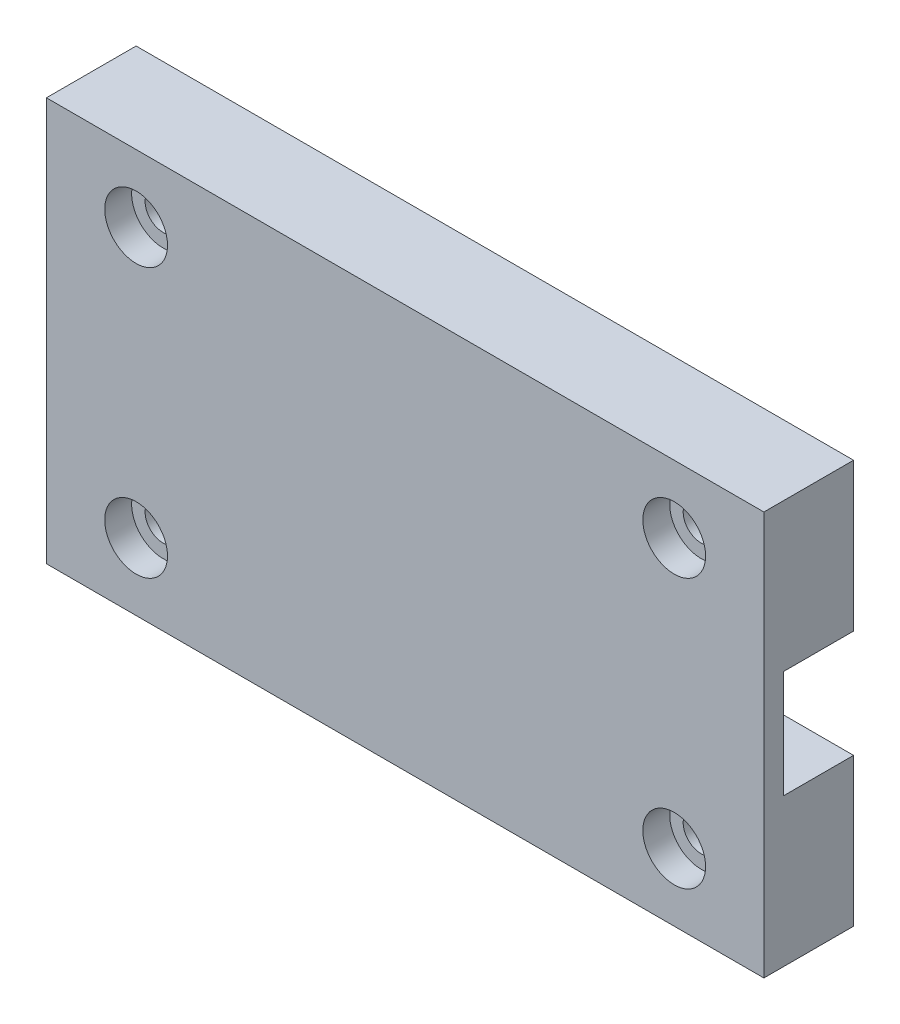
ISO-10303-21;
HEADER;
FILE_DESCRIPTION(('STEP AP214'),'2;1');
FILE_NAME('part.step','',(''),(''),'','','');
FILE_SCHEMA(('AUTOMOTIVE_DESIGN { 1 0 10303 214 1 1 1 1 }'));
ENDSEC;
DATA;
#1=APPLICATION_CONTEXT('core data for automotive mechanical design processes');
#2=APPLICATION_PROTOCOL_DEFINITION('international standard','automotive_design',2000,#1);
#3=PRODUCT_CONTEXT('',#1,'mechanical');
#4=PRODUCT('Part','Part','',(#3));
#5=PRODUCT_RELATED_PRODUCT_CATEGORY('part','',(#4));
#6=PRODUCT_DEFINITION_FORMATION('','',#4);
#7=PRODUCT_DEFINITION_CONTEXT('part definition',#1,'design');
#8=PRODUCT_DEFINITION('design','',#6,#7);
#9=PRODUCT_DEFINITION_SHAPE('','',#8);
#10=(LENGTH_UNIT() NAMED_UNIT(*) SI_UNIT(.MILLI.,.METRE.));
#11=(NAMED_UNIT(*) PLANE_ANGLE_UNIT() SI_UNIT($,.RADIAN.));
#12=(NAMED_UNIT(*) SI_UNIT($,.STERADIAN.) SOLID_ANGLE_UNIT());
#13=UNCERTAINTY_MEASURE_WITH_UNIT(LENGTH_MEASURE(1.E-05),#10,'distance_accuracy_value','');
#14=(GEOMETRIC_REPRESENTATION_CONTEXT(3) GLOBAL_UNCERTAINTY_ASSIGNED_CONTEXT((#13)) GLOBAL_UNIT_ASSIGNED_CONTEXT((#10,
#11,#12)) REPRESENTATION_CONTEXT('',''));
#15=CARTESIAN_POINT('',(0.,0.,0.));
#16=DIRECTION('',(0.,0.,1.));
#17=DIRECTION('',(1.,0.,0.));
#18=AXIS2_PLACEMENT_3D('',#15,#16,#17);
#19=CARTESIAN_POINT('',(10.,7.49999999989893,0.));
#20=DIRECTION('',(0.,0.,1.));
#21=DIRECTION('',(1.,0.,0.));
#22=AXIS2_PLACEMENT_3D('',#19,#20,#21);
#23=CYLINDRICAL_SURFACE('',#22,2.);
#24=CARTESIAN_POINT('',(10.,7.49999999989893,0.));
#25=DIRECTION('',(0.,0.,1.));
#26=DIRECTION('',(1.,0.,0.));
#27=AXIS2_PLACEMENT_3D('',#24,#25,#26);
#28=CIRCLE('',#27,2.);
#29=CARTESIAN_POINT('',(12.,7.49999999989893,0.));
#30=VERTEX_POINT('',#29);
#31=EDGE_CURVE('E181',#30,#30,#28,.T.);
#32=ORIENTED_EDGE('',*,*,#31,.F.);
#33=EDGE_LOOP('',(#32));
#34=FACE_BOUND('',#33,.T.);
#35=CARTESIAN_POINT('',(10.,7.49999999989893,7.));
#36=DIRECTION('',(0.,0.,1.));
#37=DIRECTION('',(1.,0.,0.));
#38=AXIS2_PLACEMENT_3D('',#35,#36,#37);
#39=CIRCLE('',#38,2.);
#40=CARTESIAN_POINT('',(12.,7.49999999989893,7.));
#41=VERTEX_POINT('',#40);
#42=EDGE_CURVE('E43',#41,#41,#39,.F.);
#43=ORIENTED_EDGE('',*,*,#42,.F.);
#44=EDGE_LOOP('',(#43));
#45=FACE_BOUND('',#44,.T.);
#46=ADVANCED_FACE('F39',(#34,#45),#23,.F.);
#47=CARTESIAN_POINT('',(70.,7.49999999989894,0.));
#48=DIRECTION('',(0.,0.,1.));
#49=DIRECTION('',(1.,0.,0.));
#50=AXIS2_PLACEMENT_3D('',#47,#48,#49);
#51=CYLINDRICAL_SURFACE('',#50,2.);
#52=CARTESIAN_POINT('',(70.,7.49999999989894,0.));
#53=DIRECTION('',(0.,0.,1.));
#54=DIRECTION('',(1.,0.,0.));
#55=AXIS2_PLACEMENT_3D('',#52,#53,#54);
#56=CIRCLE('',#55,2.);
#57=CARTESIAN_POINT('',(72.,7.49999999989894,0.));
#58=VERTEX_POINT('',#57);
#59=EDGE_CURVE('E185',#58,#58,#56,.T.);
#60=ORIENTED_EDGE('',*,*,#59,.F.);
#61=EDGE_LOOP('',(#60));
#62=FACE_BOUND('',#61,.T.);
#63=CARTESIAN_POINT('',(70.,7.49999999989894,7.));
#64=DIRECTION('',(0.,0.,1.));
#65=DIRECTION('',(1.,0.,0.));
#66=AXIS2_PLACEMENT_3D('',#63,#64,#65);
#67=CIRCLE('',#66,2.);
#68=CARTESIAN_POINT('',(72.,7.49999999989894,7.));
#69=VERTEX_POINT('',#68);
#70=EDGE_CURVE('E176',#69,#69,#67,.F.);
#71=ORIENTED_EDGE('',*,*,#70,.F.);
#72=EDGE_LOOP('',(#71));
#73=FACE_BOUND('',#72,.T.);
#74=ADVANCED_FACE('F225',(#62,#73),#51,.F.);
#75=CARTESIAN_POINT('',(70.,37.4999999998989,0.));
#76=DIRECTION('',(0.,0.,1.));
#77=DIRECTION('',(1.,0.,0.));
#78=AXIS2_PLACEMENT_3D('',#75,#76,#77);
#79=CYLINDRICAL_SURFACE('',#78,2.);
#80=CARTESIAN_POINT('',(70.,37.4999999998989,0.));
#81=DIRECTION('',(0.,0.,1.));
#82=DIRECTION('',(1.,0.,0.));
#83=AXIS2_PLACEMENT_3D('',#80,#81,#82);
#84=CIRCLE('',#83,2.);
#85=CARTESIAN_POINT('',(72.,37.4999999998989,0.));
#86=VERTEX_POINT('',#85);
#87=EDGE_CURVE('E197',#86,#86,#84,.T.);
#88=ORIENTED_EDGE('',*,*,#87,.F.);
#89=EDGE_LOOP('',(#88));
#90=FACE_BOUND('',#89,.T.);
#91=CARTESIAN_POINT('',(70.,37.4999999998989,7.));
#92=DIRECTION('',(0.,0.,1.));
#93=DIRECTION('',(1.,0.,0.));
#94=AXIS2_PLACEMENT_3D('',#91,#92,#93);
#95=CIRCLE('',#94,2.);
#96=CARTESIAN_POINT('',(72.,37.4999999998989,7.));
#97=VERTEX_POINT('',#96);
#98=EDGE_CURVE('E173',#97,#97,#95,.F.);
#99=ORIENTED_EDGE('',*,*,#98,.F.);
#100=EDGE_LOOP('',(#99));
#101=FACE_BOUND('',#100,.T.);
#102=ADVANCED_FACE('F231',(#90,#101),#79,.F.);
#103=CARTESIAN_POINT('',(10.,37.4999999998989,0.));
#104=DIRECTION('',(0.,0.,1.));
#105=DIRECTION('',(1.,0.,0.));
#106=AXIS2_PLACEMENT_3D('',#103,#104,#105);
#107=CYLINDRICAL_SURFACE('',#106,2.);
#108=CARTESIAN_POINT('',(10.,37.4999999998989,0.));
#109=DIRECTION('',(0.,0.,1.));
#110=DIRECTION('',(1.,0.,0.));
#111=AXIS2_PLACEMENT_3D('',#108,#109,#110);
#112=CIRCLE('',#111,2.);
#113=CARTESIAN_POINT('',(12.,37.4999999998989,0.));
#114=VERTEX_POINT('',#113);
#115=EDGE_CURVE('E190',#114,#114,#112,.T.);
#116=ORIENTED_EDGE('',*,*,#115,.F.);
#117=EDGE_LOOP('',(#116));
#118=FACE_BOUND('',#117,.T.);
#119=CARTESIAN_POINT('',(10.,37.4999999998989,7.));
#120=DIRECTION('',(0.,0.,1.));
#121=DIRECTION('',(1.,0.,0.));
#122=AXIS2_PLACEMENT_3D('',#119,#120,#121);
#123=CIRCLE('',#122,2.);
#124=CARTESIAN_POINT('',(12.,37.4999999998989,7.));
#125=VERTEX_POINT('',#124);
#126=EDGE_CURVE('E170',#125,#125,#123,.F.);
#127=ORIENTED_EDGE('',*,*,#126,.F.);
#128=EDGE_LOOP('',(#127));
#129=FACE_BOUND('',#128,.T.);
#130=ADVANCED_FACE('F239',(#118,#129),#107,.F.);
#131=CARTESIAN_POINT('',(0.,0.,0.));
#132=DIRECTION('',(0.,0.,-1.));
#133=DIRECTION('',(-1.,0.,0.));
#134=AXIS2_PLACEMENT_3D('',#131,#132,#133);
#135=PLANE('',#134);
#136=ORIENTED_EDGE('',*,*,#115,.T.);
#137=EDGE_LOOP('',(#136));
#138=FACE_BOUND('',#137,.T.);
#139=ORIENTED_EDGE('',*,*,#87,.T.);
#140=EDGE_LOOP('',(#139));
#141=FACE_BOUND('',#140,.T.);
#142=DIRECTION('',(1.,0.,0.));
#143=VECTOR('',#142,1.);
#144=CARTESIAN_POINT('',(0.,28.4999999997978,0.));
#145=LINE('',#144,#143);
#146=CARTESIAN_POINT('',(0.,28.4999999997978,0.));
#147=VERTEX_POINT('',#146);
#148=CARTESIAN_POINT('',(80.,28.4999999997978,0.));
#149=VERTEX_POINT('',#148);
#150=EDGE_CURVE('E11',#147,#149,#145,.T.);
#151=ORIENTED_EDGE('',*,*,#150,.F.);
#152=DIRECTION('',(0.,-1.,0.));
#153=VECTOR('',#152,1.);
#154=CARTESIAN_POINT('',(0.,0.,0.));
#155=LINE('',#154,#153);
#156=CARTESIAN_POINT('',(0.,44.9999999997978,0.));
#157=VERTEX_POINT('',#156);
#158=EDGE_CURVE('E156',#157,#147,#155,.T.);
#159=ORIENTED_EDGE('',*,*,#158,.F.);
#160=DIRECTION('',(-1.,0.,0.));
#161=VECTOR('',#160,1.);
#162=CARTESIAN_POINT('',(0.,44.9999999997978,0.));
#163=LINE('',#162,#161);
#164=CARTESIAN_POINT('',(80.,44.9999999997978,0.));
#165=VERTEX_POINT('',#164);
#166=EDGE_CURVE('E86',#165,#157,#163,.T.);
#167=ORIENTED_EDGE('',*,*,#166,.F.);
#168=DIRECTION('',(0.,1.,0.));
#169=VECTOR('',#168,1.);
#170=CARTESIAN_POINT('',(80.,0.,0.));
#171=LINE('',#170,#169);
#172=EDGE_CURVE('E161',#149,#165,#171,.T.);
#173=ORIENTED_EDGE('',*,*,#172,.F.);
#174=EDGE_LOOP('',(#151,#159,#167,#173));
#175=FACE_BOUND('',#174,.T.);
#176=ADVANCED_FACE('F241',(#138,#141,#175),#135,.T.);
#177=CARTESIAN_POINT('',(0.,0.,10.));
#178=DIRECTION('',(1.,0.,0.));
#179=DIRECTION('',(0.,0.,-1.));
#180=AXIS2_PLACEMENT_3D('',#177,#178,#179);
#181=PLANE('',#180);
#182=ORIENTED_EDGE('',*,*,#158,.T.);
#183=DIRECTION('',(0.,0.,1.));
#184=VECTOR('',#183,1.);
#185=CARTESIAN_POINT('',(0.,28.4999999997978,10.));
#186=LINE('',#185,#184);
#187=CARTESIAN_POINT('',(0.,28.4999999997978,7.8));
#188=VERTEX_POINT('',#187);
#189=EDGE_CURVE('E143',#147,#188,#186,.T.);
#190=ORIENTED_EDGE('',*,*,#189,.T.);
#191=DIRECTION('',(0.,-1.,0.));
#192=VECTOR('',#191,1.);
#193=CARTESIAN_POINT('',(0.,0.,7.8));
#194=LINE('',#193,#192);
#195=CARTESIAN_POINT('',(0.,16.5,7.8));
#196=VERTEX_POINT('',#195);
#197=EDGE_CURVE('E146',#188,#196,#194,.T.);
#198=ORIENTED_EDGE('',*,*,#197,.T.);
#199=DIRECTION('',(0.,0.,-1.));
#200=VECTOR('',#199,1.);
#201=CARTESIAN_POINT('',(0.,16.5,10.));
#202=LINE('',#201,#200);
#203=CARTESIAN_POINT('',(0.,16.5,0.));
#204=VERTEX_POINT('',#203);
#205=EDGE_CURVE('E117',#196,#204,#202,.T.);
#206=ORIENTED_EDGE('',*,*,#205,.T.);
#207=CARTESIAN_POINT('',(0.,0.,0.));
#208=VERTEX_POINT('',#207);
#209=EDGE_CURVE('E148',#204,#208,#155,.T.);
#210=ORIENTED_EDGE('',*,*,#209,.T.);
#211=DIRECTION('',(0.,0.,-1.));
#212=VECTOR('',#211,1.);
#213=CARTESIAN_POINT('',(0.,0.,10.));
#214=LINE('',#213,#212);
#215=CARTESIAN_POINT('',(0.,0.,10.));
#216=VERTEX_POINT('',#215);
#217=EDGE_CURVE('E48',#216,#208,#214,.T.);
#218=ORIENTED_EDGE('',*,*,#217,.F.);
#219=DIRECTION('',(0.,-1.,0.));
#220=VECTOR('',#219,1.);
#221=CARTESIAN_POINT('',(0.,0.,10.));
#222=LINE('',#221,#220);
#223=CARTESIAN_POINT('',(0.,44.9999999997978,10.));
#224=VERTEX_POINT('',#223);
#225=EDGE_CURVE('E149',#224,#216,#222,.T.);
#226=ORIENTED_EDGE('',*,*,#225,.F.);
#227=DIRECTION('',(0.,0.,-1.));
#228=VECTOR('',#227,1.);
#229=CARTESIAN_POINT('',(0.,44.9999999997978,10.));
#230=LINE('',#229,#228);
#231=EDGE_CURVE('E155',#224,#157,#230,.T.);
#232=ORIENTED_EDGE('',*,*,#231,.T.);
#233=EDGE_LOOP('',(#182,#190,#198,#206,#210,#218,#226,#232));
#234=FACE_BOUND('',#233,.T.);
#235=ADVANCED_FACE('F41',(#234),#181,.F.);
#236=CARTESIAN_POINT('',(0.,0.,10.));
#237=DIRECTION('',(0.,1.,0.));
#238=DIRECTION('',(0.,0.,1.));
#239=AXIS2_PLACEMENT_3D('',#236,#237,#238);
#240=PLANE('',#239);
#241=DIRECTION('',(1.,0.,0.));
#242=VECTOR('',#241,1.);
#243=CARTESIAN_POINT('',(0.,0.,0.));
#244=LINE('',#243,#242);
#245=CARTESIAN_POINT('',(80.,0.,0.));
#246=VERTEX_POINT('',#245);
#247=EDGE_CURVE('E159',#208,#246,#244,.T.);
#248=ORIENTED_EDGE('',*,*,#247,.T.);
#249=DIRECTION('',(0.,0.,-1.));
#250=VECTOR('',#249,1.);
#251=CARTESIAN_POINT('',(80.,0.,10.));
#252=LINE('',#251,#250);
#253=CARTESIAN_POINT('',(80.,0.,10.));
#254=VERTEX_POINT('',#253);
#255=EDGE_CURVE('E167',#254,#246,#252,.T.);
#256=ORIENTED_EDGE('',*,*,#255,.F.);
#257=DIRECTION('',(1.,0.,0.));
#258=VECTOR('',#257,1.);
#259=CARTESIAN_POINT('',(0.,0.,10.));
#260=LINE('',#259,#258);
#261=EDGE_CURVE('E94',#216,#254,#260,.T.);
#262=ORIENTED_EDGE('',*,*,#261,.F.);
#263=ORIENTED_EDGE('',*,*,#217,.T.);
#264=EDGE_LOOP('',(#248,#256,#262,#263));
#265=FACE_BOUND('',#264,.T.);
#266=ADVANCED_FACE('F206',(#265),#240,.F.);
#267=CARTESIAN_POINT('',(80.,0.,10.));
#268=DIRECTION('',(-1.,0.,0.));
#269=DIRECTION('',(0.,0.,1.));
#270=AXIS2_PLACEMENT_3D('',#267,#268,#269);
#271=PLANE('',#270);
#272=DIRECTION('',(0.,-1.,0.));
#273=VECTOR('',#272,1.);
#274=CARTESIAN_POINT('',(80.,16.5,7.8));
#275=LINE('',#274,#273);
#276=CARTESIAN_POINT('',(80.,28.4999999997978,7.8));
#277=VERTEX_POINT('',#276);
#278=CARTESIAN_POINT('',(80.,16.5,7.8));
#279=VERTEX_POINT('',#278);
#280=EDGE_CURVE('E121',#277,#279,#275,.T.);
#281=ORIENTED_EDGE('',*,*,#280,.F.);
#282=DIRECTION('',(0.,0.,-1.));
#283=VECTOR('',#282,1.);
#284=CARTESIAN_POINT('',(80.,28.4999999997978,7.8));
#285=LINE('',#284,#283);
#286=EDGE_CURVE('E136',#277,#149,#285,.T.);
#287=ORIENTED_EDGE('',*,*,#286,.T.);
#288=ORIENTED_EDGE('',*,*,#172,.T.);
#289=DIRECTION('',(0.,0.,-1.));
#290=VECTOR('',#289,1.);
#291=CARTESIAN_POINT('',(80.,44.9999999997978,10.));
#292=LINE('',#291,#290);
#293=CARTESIAN_POINT('',(80.,44.9999999997978,10.));
#294=VERTEX_POINT('',#293);
#295=EDGE_CURVE('E165',#294,#165,#292,.T.);
#296=ORIENTED_EDGE('',*,*,#295,.F.);
#297=DIRECTION('',(0.,1.,0.));
#298=VECTOR('',#297,1.);
#299=CARTESIAN_POINT('',(80.,0.,10.));
#300=LINE('',#299,#298);
#301=EDGE_CURVE('E152',#254,#294,#300,.T.);
#302=ORIENTED_EDGE('',*,*,#301,.F.);
#303=ORIENTED_EDGE('',*,*,#255,.T.);
#304=CARTESIAN_POINT('',(80.,16.5,0.));
#305=VERTEX_POINT('',#304);
#306=EDGE_CURVE('E135',#246,#305,#171,.T.);
#307=ORIENTED_EDGE('',*,*,#306,.T.);
#308=DIRECTION('',(0.,0.,-1.));
#309=VECTOR('',#308,1.);
#310=CARTESIAN_POINT('',(80.,16.5,7.8));
#311=LINE('',#310,#309);
#312=EDGE_CURVE('E56',#279,#305,#311,.T.);
#313=ORIENTED_EDGE('',*,*,#312,.F.);
#314=EDGE_LOOP('',(#281,#287,#288,#296,#302,#303,#307,#313));
#315=FACE_BOUND('',#314,.T.);
#316=ADVANCED_FACE('F132',(#315),#271,.F.);
#317=CARTESIAN_POINT('',(0.,44.9999999997978,10.));
#318=DIRECTION('',(0.,-1.,0.));
#319=DIRECTION('',(0.,0.,-1.));
#320=AXIS2_PLACEMENT_3D('',#317,#318,#319);
#321=PLANE('',#320);
#322=ORIENTED_EDGE('',*,*,#166,.T.);
#323=ORIENTED_EDGE('',*,*,#231,.F.);
#324=DIRECTION('',(-1.,0.,0.));
#325=VECTOR('',#324,1.);
#326=CARTESIAN_POINT('',(0.,44.9999999997978,10.));
#327=LINE('',#326,#325);
#328=EDGE_CURVE('E65',#294,#224,#327,.T.);
#329=ORIENTED_EDGE('',*,*,#328,.F.);
#330=ORIENTED_EDGE('',*,*,#295,.T.);
#331=EDGE_LOOP('',(#322,#323,#329,#330));
#332=FACE_BOUND('',#331,.T.);
#333=ADVANCED_FACE('F213',(#332),#321,.F.);
#334=CARTESIAN_POINT('',(0.,0.,10.));
#335=DIRECTION('',(0.,0.,-1.));
#336=DIRECTION('',(-1.,0.,0.));
#337=AXIS2_PLACEMENT_3D('',#334,#335,#336);
#338=PLANE('',#337);
#339=CARTESIAN_POINT('',(10.,7.49999999989893,10.));
#340=DIRECTION('',(0.,0.,1.));
#341=DIRECTION('',(1.,0.,0.));
#342=AXIS2_PLACEMENT_3D('',#339,#340,#341);
#343=CIRCLE('',#342,3.5);
#344=CARTESIAN_POINT('',(13.5,7.49999999989893,10.));
#345=VERTEX_POINT('',#344);
#346=EDGE_CURVE('E313',#345,#345,#343,.T.);
#347=ORIENTED_EDGE('',*,*,#346,.F.);
#348=EDGE_LOOP('',(#347));
#349=FACE_BOUND('',#348,.T.);
#350=CARTESIAN_POINT('',(70.,7.49999999989894,10.));
#351=DIRECTION('',(0.,0.,1.));
#352=DIRECTION('',(1.,0.,0.));
#353=AXIS2_PLACEMENT_3D('',#350,#351,#352);
#354=CIRCLE('',#353,3.50000000000001);
#355=CARTESIAN_POINT('',(73.5,7.49999999989894,10.));
#356=VERTEX_POINT('',#355);
#357=EDGE_CURVE('E319',#356,#356,#354,.T.);
#358=ORIENTED_EDGE('',*,*,#357,.F.);
#359=EDGE_LOOP('',(#358));
#360=FACE_BOUND('',#359,.T.);
#361=CARTESIAN_POINT('',(70.,37.4999999998989,10.));
#362=DIRECTION('',(0.,0.,1.));
#363=DIRECTION('',(1.,0.,0.));
#364=AXIS2_PLACEMENT_3D('',#361,#362,#363);
#365=CIRCLE('',#364,3.50000000000001);
#366=CARTESIAN_POINT('',(73.5,37.4999999998989,10.));
#367=VERTEX_POINT('',#366);
#368=EDGE_CURVE('E325',#367,#367,#365,.T.);
#369=ORIENTED_EDGE('',*,*,#368,.F.);
#370=EDGE_LOOP('',(#369));
#371=FACE_BOUND('',#370,.T.);
#372=CARTESIAN_POINT('',(10.,37.4999999998989,10.));
#373=DIRECTION('',(0.,0.,1.));
#374=DIRECTION('',(1.,0.,0.));
#375=AXIS2_PLACEMENT_3D('',#372,#373,#374);
#376=CIRCLE('',#375,3.5);
#377=CARTESIAN_POINT('',(13.5,37.4999999998989,10.));
#378=VERTEX_POINT('',#377);
#379=EDGE_CURVE('E194',#378,#378,#376,.T.);
#380=ORIENTED_EDGE('',*,*,#379,.F.);
#381=EDGE_LOOP('',(#380));
#382=FACE_BOUND('',#381,.T.);
#383=ORIENTED_EDGE('',*,*,#225,.T.);
#384=ORIENTED_EDGE('',*,*,#261,.T.);
#385=ORIENTED_EDGE('',*,*,#301,.T.);
#386=ORIENTED_EDGE('',*,*,#328,.T.);
#387=EDGE_LOOP('',(#383,#384,#385,#386));
#388=FACE_BOUND('',#387,.T.);
#389=ADVANCED_FACE('F209',(#349,#360,#371,#382,#388),#338,.F.);
#390=ORIENTED_EDGE('',*,*,#59,.T.);
#391=EDGE_LOOP('',(#390));
#392=FACE_BOUND('',#391,.T.);
#393=ORIENTED_EDGE('',*,*,#31,.T.);
#394=EDGE_LOOP('',(#393));
#395=FACE_BOUND('',#394,.T.);
#396=DIRECTION('',(-1.,0.,0.));
#397=VECTOR('',#396,1.);
#398=CARTESIAN_POINT('',(80.,16.5,0.));
#399=LINE('',#398,#397);
#400=EDGE_CURVE('E129',#305,#204,#399,.T.);
#401=ORIENTED_EDGE('',*,*,#400,.F.);
#402=ORIENTED_EDGE('',*,*,#306,.F.);
#403=ORIENTED_EDGE('',*,*,#247,.F.);
#404=ORIENTED_EDGE('',*,*,#209,.F.);
#405=EDGE_LOOP('',(#401,#402,#403,#404));
#406=FACE_BOUND('',#405,.T.);
#407=ADVANCED_FACE('F205',(#392,#395,#406),#135,.T.);
#408=CARTESIAN_POINT('',(0.,0.,7.8));
#409=DIRECTION('',(0.,0.,1.));
#410=DIRECTION('',(1.,0.,0.));
#411=AXIS2_PLACEMENT_3D('',#408,#409,#410);
#412=PLANE('',#411);
#413=DIRECTION('',(1.,0.,0.));
#414=VECTOR('',#413,1.);
#415=CARTESIAN_POINT('',(80.,28.4999999997978,7.8));
#416=LINE('',#415,#414);
#417=EDGE_CURVE('E120',#188,#277,#416,.T.);
#418=ORIENTED_EDGE('',*,*,#417,.T.);
#419=ORIENTED_EDGE('',*,*,#280,.T.);
#420=DIRECTION('',(-1.,0.,0.));
#421=VECTOR('',#420,1.);
#422=CARTESIAN_POINT('',(80.,16.5,7.8));
#423=LINE('',#422,#421);
#424=EDGE_CURVE('E113',#279,#196,#423,.T.);
#425=ORIENTED_EDGE('',*,*,#424,.T.);
#426=ORIENTED_EDGE('',*,*,#197,.F.);
#427=EDGE_LOOP('',(#418,#419,#425,#426));
#428=FACE_BOUND('',#427,.T.);
#429=ADVANCED_FACE('F124',(#428),#412,.F.);
#430=CARTESIAN_POINT('',(80.,28.4999999997978,7.8));
#431=DIRECTION('',(0.,1.,0.));
#432=DIRECTION('',(0.,0.,1.));
#433=AXIS2_PLACEMENT_3D('',#430,#431,#432);
#434=PLANE('',#433);
#435=ORIENTED_EDGE('',*,*,#150,.T.);
#436=ORIENTED_EDGE('',*,*,#286,.F.);
#437=ORIENTED_EDGE('',*,*,#417,.F.);
#438=ORIENTED_EDGE('',*,*,#189,.F.);
#439=EDGE_LOOP('',(#435,#436,#437,#438));
#440=FACE_BOUND('',#439,.T.);
#441=ADVANCED_FACE('F249',(#440),#434,.F.);
#442=CARTESIAN_POINT('',(80.,16.5,7.8));
#443=DIRECTION('',(0.,-1.,0.));
#444=DIRECTION('',(0.,0.,-1.));
#445=AXIS2_PLACEMENT_3D('',#442,#443,#444);
#446=PLANE('',#445);
#447=ORIENTED_EDGE('',*,*,#424,.F.);
#448=ORIENTED_EDGE('',*,*,#312,.T.);
#449=ORIENTED_EDGE('',*,*,#400,.T.);
#450=ORIENTED_EDGE('',*,*,#205,.F.);
#451=EDGE_LOOP('',(#447,#448,#449,#450));
#452=FACE_BOUND('',#451,.T.);
#453=ADVANCED_FACE('F115',(#452),#446,.F.);
#454=CARTESIAN_POINT('',(10.,37.4999999998989,7.));
#455=DIRECTION('',(0.,0.,1.));
#456=DIRECTION('',(1.,0.,0.));
#457=AXIS2_PLACEMENT_3D('',#454,#455,#456);
#458=PLANE('',#457);
#459=CARTESIAN_POINT('',(10.,37.4999999998989,7.));
#460=DIRECTION('',(0.,0.,1.));
#461=DIRECTION('',(1.,0.,0.));
#462=AXIS2_PLACEMENT_3D('',#459,#460,#461);
#463=CIRCLE('',#462,3.5);
#464=CARTESIAN_POINT('',(13.5,37.4999999998989,7.));
#465=VERTEX_POINT('',#464);
#466=EDGE_CURVE('E174',#465,#465,#463,.T.);
#467=ORIENTED_EDGE('',*,*,#466,.T.);
#468=EDGE_LOOP('',(#467));
#469=FACE_BOUND('',#468,.T.);
#470=ORIENTED_EDGE('',*,*,#126,.T.);
#471=EDGE_LOOP('',(#470));
#472=FACE_BOUND('',#471,.T.);
#473=ADVANCED_FACE('F254',(#469,#472),#458,.T.);
#474=CARTESIAN_POINT('',(10.,37.4999999998989,7.));
#475=DIRECTION('',(0.,0.,1.));
#476=DIRECTION('',(1.,0.,0.));
#477=AXIS2_PLACEMENT_3D('',#474,#475,#476);
#478=CYLINDRICAL_SURFACE('',#477,3.5);
#479=ORIENTED_EDGE('',*,*,#466,.F.);
#480=EDGE_LOOP('',(#479));
#481=FACE_BOUND('',#480,.T.);
#482=ORIENTED_EDGE('',*,*,#379,.T.);
#483=EDGE_LOOP('',(#482));
#484=FACE_BOUND('',#483,.T.);
#485=ADVANCED_FACE('F237',(#481,#484),#478,.F.);
#486=CARTESIAN_POINT('',(70.,37.4999999998989,7.));
#487=DIRECTION('',(0.,0.,1.));
#488=DIRECTION('',(1.,0.,0.));
#489=AXIS2_PLACEMENT_3D('',#486,#487,#488);
#490=PLANE('',#489);
#491=CARTESIAN_POINT('',(70.,37.4999999998989,7.));
#492=DIRECTION('',(0.,0.,1.));
#493=DIRECTION('',(1.,0.,0.));
#494=AXIS2_PLACEMENT_3D('',#491,#492,#493);
#495=CIRCLE('',#494,3.50000000000001);
#496=CARTESIAN_POINT('',(73.5,37.4999999998989,7.));
#497=VERTEX_POINT('',#496);
#498=EDGE_CURVE('E311',#497,#497,#495,.T.);
#499=ORIENTED_EDGE('',*,*,#498,.T.);
#500=EDGE_LOOP('',(#499));
#501=FACE_BOUND('',#500,.T.);
#502=ORIENTED_EDGE('',*,*,#98,.T.);
#503=EDGE_LOOP('',(#502));
#504=FACE_BOUND('',#503,.T.);
#505=ADVANCED_FACE('F272',(#501,#504),#490,.T.);
#506=CARTESIAN_POINT('',(70.,37.4999999998989,7.));
#507=DIRECTION('',(0.,0.,1.));
#508=DIRECTION('',(1.,0.,0.));
#509=AXIS2_PLACEMENT_3D('',#506,#507,#508);
#510=CYLINDRICAL_SURFACE('',#509,3.50000000000001);
#511=ORIENTED_EDGE('',*,*,#498,.F.);
#512=EDGE_LOOP('',(#511));
#513=FACE_BOUND('',#512,.T.);
#514=ORIENTED_EDGE('',*,*,#368,.T.);
#515=EDGE_LOOP('',(#514));
#516=FACE_BOUND('',#515,.T.);
#517=ADVANCED_FACE('F274',(#513,#516),#510,.F.);
#518=CARTESIAN_POINT('',(70.,7.49999999989894,7.));
#519=DIRECTION('',(0.,0.,1.));
#520=DIRECTION('',(1.,0.,0.));
#521=AXIS2_PLACEMENT_3D('',#518,#519,#520);
#522=PLANE('',#521);
#523=CARTESIAN_POINT('',(70.,7.49999999989894,7.));
#524=DIRECTION('',(0.,0.,1.));
#525=DIRECTION('',(1.,0.,0.));
#526=AXIS2_PLACEMENT_3D('',#523,#524,#525);
#527=CIRCLE('',#526,3.50000000000001);
#528=CARTESIAN_POINT('',(73.5,7.49999999989894,7.));
#529=VERTEX_POINT('',#528);
#530=EDGE_CURVE('E322',#529,#529,#527,.T.);
#531=ORIENTED_EDGE('',*,*,#530,.T.);
#532=EDGE_LOOP('',(#531));
#533=FACE_BOUND('',#532,.T.);
#534=ORIENTED_EDGE('',*,*,#70,.T.);
#535=EDGE_LOOP('',(#534));
#536=FACE_BOUND('',#535,.T.);
#537=ADVANCED_FACE('F281',(#533,#536),#522,.T.);
#538=CARTESIAN_POINT('',(70.,7.49999999989894,7.));
#539=DIRECTION('',(0.,0.,1.));
#540=DIRECTION('',(1.,0.,0.));
#541=AXIS2_PLACEMENT_3D('',#538,#539,#540);
#542=CYLINDRICAL_SURFACE('',#541,3.50000000000001);
#543=ORIENTED_EDGE('',*,*,#530,.F.);
#544=EDGE_LOOP('',(#543));
#545=FACE_BOUND('',#544,.T.);
#546=ORIENTED_EDGE('',*,*,#357,.T.);
#547=EDGE_LOOP('',(#546));
#548=FACE_BOUND('',#547,.T.);
#549=ADVANCED_FACE('F289',(#545,#548),#542,.F.);
#550=CARTESIAN_POINT('',(10.,7.49999999989893,7.));
#551=DIRECTION('',(0.,0.,1.));
#552=DIRECTION('',(1.,0.,0.));
#553=AXIS2_PLACEMENT_3D('',#550,#551,#552);
#554=PLANE('',#553);
#555=CARTESIAN_POINT('',(10.,7.49999999989893,7.));
#556=DIRECTION('',(0.,0.,1.));
#557=DIRECTION('',(1.,0.,0.));
#558=AXIS2_PLACEMENT_3D('',#555,#556,#557);
#559=CIRCLE('',#558,3.5);
#560=CARTESIAN_POINT('',(13.5,7.49999999989893,7.));
#561=VERTEX_POINT('',#560);
#562=EDGE_CURVE('E316',#561,#561,#559,.T.);
#563=ORIENTED_EDGE('',*,*,#562,.T.);
#564=EDGE_LOOP('',(#563));
#565=FACE_BOUND('',#564,.T.);
#566=ORIENTED_EDGE('',*,*,#42,.T.);
#567=EDGE_LOOP('',(#566));
#568=FACE_BOUND('',#567,.T.);
#569=ADVANCED_FACE('F293',(#565,#568),#554,.T.);
#570=CARTESIAN_POINT('',(10.,7.49999999989893,7.));
#571=DIRECTION('',(0.,0.,1.));
#572=DIRECTION('',(1.,0.,0.));
#573=AXIS2_PLACEMENT_3D('',#570,#571,#572);
#574=CYLINDRICAL_SURFACE('',#573,3.5);
#575=ORIENTED_EDGE('',*,*,#562,.F.);
#576=EDGE_LOOP('',(#575));
#577=FACE_BOUND('',#576,.T.);
#578=ORIENTED_EDGE('',*,*,#346,.T.);
#579=EDGE_LOOP('',(#578));
#580=FACE_BOUND('',#579,.T.);
#581=ADVANCED_FACE('F297',(#577,#580),#574,.F.);
#582=CLOSED_SHELL('',(#46,#74,#102,#130,#176,#235,#266,#316,#333,#389,#407,#429,#441,#453,#473,
#485,#505,#517,#537,#549,#569,#581));
#583=MANIFOLD_SOLID_BREP('B2',#582);
#584=ADVANCED_BREP_SHAPE_REPRESENTATION('',(#18,#583),#14);
#585=SHAPE_DEFINITION_REPRESENTATION(#9,#584);
ENDSEC;
END-ISO-10303-21;
